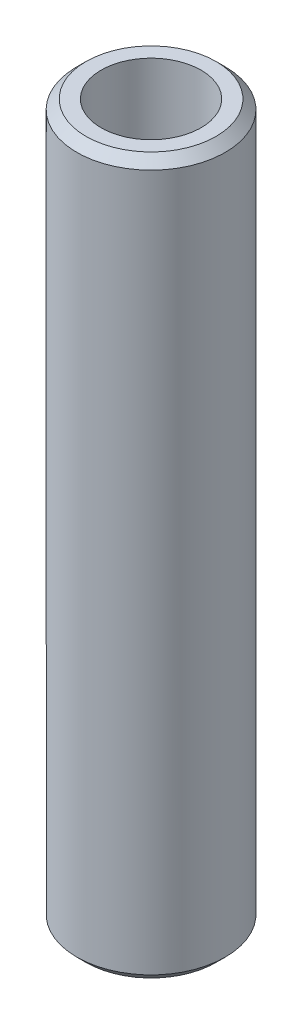
ISO-10303-21;
HEADER;
FILE_DESCRIPTION(('STEP AP214'),'2;1');
FILE_NAME('part.step','',(''),(''),'','','');
FILE_SCHEMA(('AUTOMOTIVE_DESIGN { 1 0 10303 214 1 1 1 1 }'));
ENDSEC;
DATA;
#1=APPLICATION_CONTEXT('core data for automotive mechanical design processes');
#2=APPLICATION_PROTOCOL_DEFINITION('international standard','automotive_design',2000,#1);
#3=PRODUCT_CONTEXT('',#1,'mechanical');
#4=PRODUCT('Part','Part','',(#3));
#5=PRODUCT_RELATED_PRODUCT_CATEGORY('part','',(#4));
#6=PRODUCT_DEFINITION_FORMATION('','',#4);
#7=PRODUCT_DEFINITION_CONTEXT('part definition',#1,'design');
#8=PRODUCT_DEFINITION('design','',#6,#7);
#9=PRODUCT_DEFINITION_SHAPE('','',#8);
#10=(LENGTH_UNIT() NAMED_UNIT(*) SI_UNIT(.MILLI.,.METRE.));
#11=(NAMED_UNIT(*) PLANE_ANGLE_UNIT() SI_UNIT($,.RADIAN.));
#12=(NAMED_UNIT(*) SI_UNIT($,.STERADIAN.) SOLID_ANGLE_UNIT());
#13=UNCERTAINTY_MEASURE_WITH_UNIT(LENGTH_MEASURE(1.E-05),#10,'distance_accuracy_value','');
#14=(GEOMETRIC_REPRESENTATION_CONTEXT(3) GLOBAL_UNCERTAINTY_ASSIGNED_CONTEXT((#13)) GLOBAL_UNIT_ASSIGNED_CONTEXT((#10,
#11,#12)) REPRESENTATION_CONTEXT('',''));
#15=CARTESIAN_POINT('',(0.,0.,0.));
#16=DIRECTION('',(0.,0.,1.));
#17=DIRECTION('',(1.,0.,0.));
#18=AXIS2_PLACEMENT_3D('',#15,#16,#17);
#19=CARTESIAN_POINT('',(0.,168.730452130798,0.));
#20=DIRECTION('',(0.,-1.,0.));
#21=DIRECTION('',(0.,0.,-1.));
#22=AXIS2_PLACEMENT_3D('',#19,#20,#21);
#23=CYLINDRICAL_SURFACE('',#22,17.5);
#24=CARTESIAN_POINT('',(0.,166.553626225241,0.));
#25=DIRECTION('',(0.,1.,0.));
#26=DIRECTION('',(0.,0.,1.));
#27=AXIS2_PLACEMENT_3D('',#24,#25,#26);
#28=CIRCLE('',#27,17.5);
#29=CARTESIAN_POINT('',(0.,166.553626225241,-17.5));
#30=VERTEX_POINT('',#29);
#31=EDGE_CURVE('E50',#30,#30,#28,.F.);
#32=CARTESIAN_POINT('',(0.,2.17682590555662,0.));
#33=DIRECTION('',(0.,1.,0.));
#34=DIRECTION('',(0.,0.,1.));
#35=AXIS2_PLACEMENT_3D('',#32,#33,#34);
#36=CIRCLE('',#35,17.5);
#37=CARTESIAN_POINT('',(0.,2.1768259055566,-17.5));
#38=VERTEX_POINT('',#37);
#39=EDGE_CURVE('E51',#38,#38,#36,.T.);
#40=CARTESIAN_POINT('',(0.,166.553626225241,-17.5));
#41=CARTESIAN_POINT('',(0.,164.841367888578,-17.5));
#42=CARTESIAN_POINT('',(0.,163.129109551914,-17.5));
#43=CARTESIAN_POINT('',(0.,159.704592878588,-17.5));
#44=CARTESIAN_POINT('',(0.,157.992334541924,-17.5));
#45=CARTESIAN_POINT('',(0.,154.567817868598,-17.5));
#46=CARTESIAN_POINT('',(0.,152.855559531934,-17.5));
#47=CARTESIAN_POINT('',(0.,149.431042858607,-17.5));
#48=CARTESIAN_POINT('',(0.,147.718784521944,-17.5));
#49=CARTESIAN_POINT('',(0.,144.294267848617,-17.5));
#50=CARTESIAN_POINT('',(0.,142.582009511954,-17.5));
#51=CARTESIAN_POINT('',(0.,139.157492838627,-17.5));
#52=CARTESIAN_POINT('',(0.,137.445234501964,-17.5));
#53=CARTESIAN_POINT('',(0.,134.020717828637,-17.5));
#54=CARTESIAN_POINT('',(0.,132.308459491974,-17.5));
#55=CARTESIAN_POINT('',(0.,128.883942818647,-17.5));
#56=CARTESIAN_POINT('',(0.,127.171684481983,-17.5));
#57=CARTESIAN_POINT('',(0.,123.747167808657,-17.5));
#58=CARTESIAN_POINT('',(0.,122.034909471993,-17.5));
#59=CARTESIAN_POINT('',(0.,118.610392798667,-17.5));
#60=CARTESIAN_POINT('',(0.,116.898134462003,-17.5));
#61=CARTESIAN_POINT('',(0.,113.473617788676,-17.5));
#62=CARTESIAN_POINT('',(0.,111.761359452013,-17.5));
#63=CARTESIAN_POINT('',(0.,108.336842778686,-17.5));
#64=CARTESIAN_POINT('',(0.,106.624584442023,-17.5));
#65=CARTESIAN_POINT('',(0.,103.200067768696,-17.5));
#66=CARTESIAN_POINT('',(0.,101.487809432033,-17.5));
#67=CARTESIAN_POINT('',(0.,98.063292758706,-17.5));
#68=CARTESIAN_POINT('',(0.,96.3510344220426,-17.5));
#69=CARTESIAN_POINT('',(0.,92.9265177487158,-17.5));
#70=CARTESIAN_POINT('',(0.,91.2142594120525,-17.5));
#71=CARTESIAN_POINT('',(0.,87.7897427387257,-17.5));
#72=CARTESIAN_POINT('',(0.,86.0774844020623,-17.5));
#73=CARTESIAN_POINT('',(0.,82.6529677287355,-17.5));
#74=CARTESIAN_POINT('',(0.,80.9407093920722,-17.5));
#75=CARTESIAN_POINT('',(0.,77.5161927187454,-17.5));
#76=CARTESIAN_POINT('',(0.,75.803934382082,-17.5));
#77=CARTESIAN_POINT('',(0.,72.3794177087553,-17.5));
#78=CARTESIAN_POINT('',(0.,70.6671593720919,-17.5));
#79=CARTESIAN_POINT('',(0.,67.2426426987651,-17.5));
#80=CARTESIAN_POINT('',(0.,65.5303843621017,-17.5));
#81=CARTESIAN_POINT('',(0.,62.105867688775,-17.5));
#82=CARTESIAN_POINT('',(0.,60.3936093521116,-17.5));
#83=CARTESIAN_POINT('',(0.,56.9690926787848,-17.5));
#84=CARTESIAN_POINT('',(0.,55.2568343421214,-17.5));
#85=CARTESIAN_POINT('',(0.,51.8323176687947,-17.5));
#86=CARTESIAN_POINT('',(0.,50.1200593321313,-17.5));
#87=CARTESIAN_POINT('',(0.,46.6955426588045,-17.5));
#88=CARTESIAN_POINT('',(0.,44.9832843221412,-17.5));
#89=CARTESIAN_POINT('',(0.,41.5587676488144,-17.5));
#90=CARTESIAN_POINT('',(0.,39.846509312151,-17.5));
#91=CARTESIAN_POINT('',(0.,36.4219926388242,-17.5));
#92=CARTESIAN_POINT('',(0.,34.7097343021609,-17.5));
#93=CARTESIAN_POINT('',(0.,31.2852176288341,-17.5));
#94=CARTESIAN_POINT('',(0.,29.5729592921707,-17.5));
#95=CARTESIAN_POINT('',(0.,26.1484426188439,-17.5));
#96=CARTESIAN_POINT('',(0.,24.4361842821806,-17.5));
#97=CARTESIAN_POINT('',(0.,21.0116676088538,-17.5));
#98=CARTESIAN_POINT('',(0.,19.2994092721904,-17.5));
#99=CARTESIAN_POINT('',(0.,15.8748925988637,-17.5));
#100=CARTESIAN_POINT('',(0.,14.1626342622003,-17.5));
#101=CARTESIAN_POINT('',(0.,10.7381175888735,-17.5));
#102=CARTESIAN_POINT('',(0.,9.02585925221013,-17.5));
#103=CARTESIAN_POINT('',(0.,5.60134257888337,-17.5));
#104=CARTESIAN_POINT('',(0.,3.88908424221998,-17.5));
#105=CARTESIAN_POINT('',(0.,2.1768259055566,-17.5));
#106=B_SPLINE_CURVE_WITH_KNOTS('',3,(#40,#41,#42,#43,#44,#45,#46,#47,#48,#49,#50,#51,#52,#53,
#54,#55,#56,#57,#58,#59,#60,#61,#62,#63,#64,#65,#66,#67,#68,#69,#70,#71,#72,#73,#74,#75,#76,#77,
#78,#79,#80,#81,#82,#83,#84,#85,#86,#87,#88,#89,#90,#91,#92,#93,#94,#95,#96,#97,#98,#99,#100,
#101,#102,#103,#104,#105),.UNSPECIFIED.,.F.,.F.,(4,2,2,2,2,2,2,2,2,2,2,2,2,2,2,2,2,2,2,2,2,2,2,
2,2,2,2,2,2,2,2,2,4),(0.,5.13677500999013,10.2735500199803,15.4103250299704,20.5471000399606,
25.6838750499507,30.8206500599409,35.957425069931,41.0942000799212,46.2309750899113,
51.3677500999014,56.5045251098916,61.6413001198817,66.7780751298719,71.914850139862,
77.0516251498522,82.1884001598423,87.3251751698325,92.4619501798226,97.5987251898128,
102.735500199803,107.872275209793,113.009050219783,118.145825229773,123.282600239763,
128.419375249754,133.556150259744,138.692925269734,143.829700279724,148.966475289714,
154.103250299704,159.240025309694,164.376800319685),.UNSPECIFIED.);
#107=EDGE_CURVE('BSEAM39',#30,#38,#106,.T.);
#108=ORIENTED_EDGE('',*,*,#31,.T.);
#109=ORIENTED_EDGE('',*,*,#39,.T.);
#110=ORIENTED_EDGE('',*,*,#107,.T.);
#111=ORIENTED_EDGE('',*,*,#107,.F.);
#112=EDGE_LOOP('',(#108,#110,#109,#111));
#113=FACE_BOUND('',#112,.T.);
#114=ADVANCED_FACE('F39',(#113),#23,.T.);
#115=CARTESIAN_POINT('',(0.,168.730452130798,0.));
#116=DIRECTION('',(0.,1.,0.));
#117=DIRECTION('',(0.,0.,1.));
#118=AXIS2_PLACEMENT_3D('',#115,#116,#117);
#119=PLANE('',#118);
#120=CARTESIAN_POINT('',(0.,168.730452130798,0.));
#121=DIRECTION('',(0.,1.,0.));
#122=DIRECTION('',(0.,0.,1.));
#123=AXIS2_PLACEMENT_3D('',#120,#121,#122);
#124=CIRCLE('',#123,15.3231740944437);
#125=CARTESIAN_POINT('',(0.,168.730452130798,15.3231740944437));
#126=VERTEX_POINT('',#125);
#127=EDGE_CURVE('E54',#126,#126,#124,.T.);
#128=ORIENTED_EDGE('',*,*,#127,.T.);
#129=EDGE_LOOP('',(#128));
#130=FACE_BOUND('',#129,.T.);
#131=CARTESIAN_POINT('',(0.,168.730452130798,0.));
#132=DIRECTION('',(0.,1.,0.));
#133=DIRECTION('',(0.,0.,1.));
#134=AXIS2_PLACEMENT_3D('',#131,#132,#133);
#135=CIRCLE('',#134,11.7880793473174);
#136=CARTESIAN_POINT('',(0.,168.730452130798,-11.7880793473174));
#137=VERTEX_POINT('',#136);
#138=EDGE_CURVE('E58',#137,#137,#135,.T.);
#139=ORIENTED_EDGE('',*,*,#138,.F.);
#140=EDGE_LOOP('',(#139));
#141=FACE_BOUND('',#140,.T.);
#142=ADVANCED_FACE('F69',(#130,#141),#119,.T.);
#143=CARTESIAN_POINT('',(0.,0.,0.));
#144=DIRECTION('',(0.,1.,0.));
#145=DIRECTION('',(0.,0.,1.));
#146=AXIS2_PLACEMENT_3D('',#143,#144,#145);
#147=PLANE('',#146);
#148=CARTESIAN_POINT('',(0.,0.,0.));
#149=DIRECTION('',(0.,1.,0.));
#150=DIRECTION('',(0.,0.,1.));
#151=AXIS2_PLACEMENT_3D('',#148,#149,#150);
#152=CIRCLE('',#151,15.3231740944434);
#153=CARTESIAN_POINT('',(0.,0.,15.3231740944434));
#154=VERTEX_POINT('',#153);
#155=EDGE_CURVE('E10',#154,#154,#152,.F.);
#156=ORIENTED_EDGE('',*,*,#155,.T.);
#157=EDGE_LOOP('',(#156));
#158=FACE_BOUND('',#157,.T.);
#159=CARTESIAN_POINT('',(0.,0.,0.));
#160=DIRECTION('',(0.,1.,0.));
#161=DIRECTION('',(0.,0.,1.));
#162=AXIS2_PLACEMENT_3D('',#159,#160,#161);
#163=CIRCLE('',#162,11.7880793473174);
#164=CARTESIAN_POINT('',(0.,0.,-11.7880793473174));
#165=VERTEX_POINT('',#164);
#166=EDGE_CURVE('E63',#165,#165,#163,.T.);
#167=ORIENTED_EDGE('',*,*,#166,.T.);
#168=EDGE_LOOP('',(#167));
#169=FACE_BOUND('',#168,.T.);
#170=ADVANCED_FACE('F75',(#158,#169),#147,.F.);
#171=CARTESIAN_POINT('',(0.,168.730452130798,0.));
#172=DIRECTION('',(0.,-1.,0.));
#173=DIRECTION('',(0.,0.,-1.));
#174=AXIS2_PLACEMENT_3D('',#171,#172,#173);
#175=CYLINDRICAL_SURFACE('',#174,11.7880793473174);
#176=CARTESIAN_POINT('',(0.,168.730452130798,-11.7880793473174));
#177=CARTESIAN_POINT('',(0.,166.972843254435,-11.7880793473174));
#178=CARTESIAN_POINT('',(0.,165.215234378073,-11.7880793473174));
#179=CARTESIAN_POINT('',(0.,161.700016625348,-11.7880793473174));
#180=CARTESIAN_POINT('',(0.,159.942407748985,-11.7880793473174));
#181=CARTESIAN_POINT('',(0.,156.42718999626,-11.7880793473174));
#182=CARTESIAN_POINT('',(0.,154.669581119898,-11.7880793473174));
#183=CARTESIAN_POINT('',(0.,151.154363367173,-11.7880793473174));
#184=CARTESIAN_POINT('',(0.,149.39675449081,-11.7880793473174));
#185=CARTESIAN_POINT('',(0.,145.881536738085,-11.7880793473174));
#186=CARTESIAN_POINT('',(0.,144.123927861723,-11.7880793473174));
#187=CARTESIAN_POINT('',(0.,140.608710108998,-11.7880793473174));
#188=CARTESIAN_POINT('',(0.,138.851101232636,-11.7880793473174));
#189=CARTESIAN_POINT('',(0.,135.335883479911,-11.7880793473174));
#190=CARTESIAN_POINT('',(0.,133.578274603548,-11.7880793473174));
#191=CARTESIAN_POINT('',(0.,130.063056850823,-11.7880793473174));
#192=CARTESIAN_POINT('',(0.,128.305447974461,-11.7880793473174));
#193=CARTESIAN_POINT('',(0.,124.790230221736,-11.7880793473174));
#194=CARTESIAN_POINT('',(0.,123.032621345373,-11.7880793473174));
#195=CARTESIAN_POINT('',(0.,119.517403592648,-11.7880793473174));
#196=CARTESIAN_POINT('',(0.,117.759794716286,-11.7880793473174));
#197=CARTESIAN_POINT('',(0.,114.244576963561,-11.7880793473174));
#198=CARTESIAN_POINT('',(0.,112.486968087198,-11.7880793473174));
#199=CARTESIAN_POINT('',(0.,108.971750334473,-11.7880793473174));
#200=CARTESIAN_POINT('',(0.,107.214141458111,-11.7880793473174));
#201=CARTESIAN_POINT('',(0.,103.698923705386,-11.7880793473174));
#202=CARTESIAN_POINT('',(0.,101.941314829024,-11.7880793473174));
#203=CARTESIAN_POINT('',(0.,98.4260970762986,-11.7880793473174));
#204=CARTESIAN_POINT('',(0.,96.6684881999361,-11.7880793473174));
#205=CARTESIAN_POINT('',(0.,93.1532704472112,-11.7880793473174));
#206=CARTESIAN_POINT('',(0.,91.3956615708487,-11.7880793473174));
#207=CARTESIAN_POINT('',(0.,87.8804438181237,-11.7880793473174));
#208=CARTESIAN_POINT('',(0.,86.1228349417613,-11.7880793473174));
#209=CARTESIAN_POINT('',(0.,82.6076171890363,-11.7880793473174));
#210=CARTESIAN_POINT('',(0.,80.8500083126738,-11.7880793473174));
#211=CARTESIAN_POINT('',(0.,77.3347905599489,-11.7880793473174));
#212=CARTESIAN_POINT('',(0.,75.5771816835864,-11.7880793473174));
#213=CARTESIAN_POINT('',(0.,72.0619639308615,-11.7880793473174));
#214=CARTESIAN_POINT('',(0.,70.304355054499,-11.7880793473174));
#215=CARTESIAN_POINT('',(0.,66.789137301774,-11.7880793473174));
#216=CARTESIAN_POINT('',(0.,65.0315284254116,-11.7880793473174));
#217=CARTESIAN_POINT('',(0.,61.5163106726866,-11.7880793473174));
#218=CARTESIAN_POINT('',(0.,59.7587017963241,-11.7880793473174));
#219=CARTESIAN_POINT('',(0.,56.2434840435992,-11.7880793473174));
#220=CARTESIAN_POINT('',(0.,54.4858751672367,-11.7880793473174));
#221=CARTESIAN_POINT('',(0.,50.9706574145117,-11.7880793473174));
#222=CARTESIAN_POINT('',(0.,49.2130485381493,-11.7880793473174));
#223=CARTESIAN_POINT('',(0.,45.6978307854243,-11.7880793473174));
#224=CARTESIAN_POINT('',(0.,43.9402219090619,-11.7880793473174));
#225=CARTESIAN_POINT('',(0.,40.4250041563369,-11.7880793473174));
#226=CARTESIAN_POINT('',(0.,38.6673952799745,-11.7880793473174));
#227=CARTESIAN_POINT('',(0.,35.1521775272495,-11.7880793473174));
#228=CARTESIAN_POINT('',(0.,33.394568650887,-11.7880793473174));
#229=CARTESIAN_POINT('',(0.,29.8793508981621,-11.7880793473174));
#230=CARTESIAN_POINT('',(0.,28.1217420217996,-11.7880793473174));
#231=CARTESIAN_POINT('',(0.,24.6065242690746,-11.7880793473174));
#232=CARTESIAN_POINT('',(0.,22.8489153927122,-11.7880793473174));
#233=CARTESIAN_POINT('',(0.,19.3336976399872,-11.7880793473174));
#234=CARTESIAN_POINT('',(0.,17.5760887636247,-11.7880793473174));
#235=CARTESIAN_POINT('',(0.,14.0608710108998,-11.7880793473174));
#236=CARTESIAN_POINT('',(0.,12.3032621345373,-11.7880793473174));
#237=CARTESIAN_POINT('',(0.,8.78804438181236,-11.7880793473174));
#238=CARTESIAN_POINT('',(0.,7.03043550544988,-11.7880793473174));
#239=CARTESIAN_POINT('',(0.,3.51521775272493,-11.7880793473174));
#240=CARTESIAN_POINT('',(0.,1.75760887636245,-11.7880793473174));
#241=CARTESIAN_POINT('',(0.,0.,-11.7880793473174));
#242=B_SPLINE_CURVE_WITH_KNOTS('',3,(#176,#177,#178,#179,#180,#181,#182,#183,#184,#185,#186,
#187,#188,#189,#190,#191,#192,#193,#194,#195,#196,#197,#198,#199,#200,#201,#202,#203,#204,#205,
#206,#207,#208,#209,#210,#211,#212,#213,#214,#215,#216,#217,#218,#219,#220,#221,#222,#223,#224,
#225,#226,#227,#228,#229,#230,#231,#232,#233,#234,#235,#236,#237,#238,#239,#240,#241),
.UNSPECIFIED.,.F.,.F.,(4,2,2,2,2,2,2,2,2,2,2,2,2,2,2,2,2,2,2,2,2,2,2,2,2,2,2,2,2,2,2,2,4),(0.,
5.27282662908743,10.5456532581749,15.8184798872623,21.0913065163497,26.3641331454371,
31.6369597745246,36.909786403612,42.1826130326994,47.4554396617869,52.7282662908743,
58.0010929199617,63.2739195490491,68.5467461781366,73.819572807224,79.0923994363114,
84.3652260653988,89.6380526944863,94.9108793235737,100.183705952661,105.456532581749,
110.729359210836,116.002185839923,121.275012469011,126.547839098098,131.820665727186,
137.093492356273,142.36631898536,147.639145614448,152.911972243535,158.184798872623,
163.45762550171,168.730452130798),.UNSPECIFIED.);
#243=EDGE_CURVE('BSEAM70',#137,#165,#242,.T.);
#244=ORIENTED_EDGE('',*,*,#138,.T.);
#245=ORIENTED_EDGE('',*,*,#166,.F.);
#246=ORIENTED_EDGE('',*,*,#243,.T.);
#247=ORIENTED_EDGE('',*,*,#243,.F.);
#248=EDGE_LOOP('',(#244,#246,#245,#247));
#249=FACE_BOUND('',#248,.T.);
#250=ADVANCED_FACE('F70',(#249),#175,.F.);
#251=CARTESIAN_POINT('',(0.,168.730452130798,0.));
#252=DIRECTION('',(0.,-1.,0.));
#253=DIRECTION('',(0.,0.,-1.));
#254=AXIS2_PLACEMENT_3D('',#251,#252,#253);
#255=CONICAL_SURFACE('',#254,15.3231740944437,0.785398163397447);
#256=ORIENTED_EDGE('',*,*,#31,.F.);
#257=EDGE_LOOP('',(#256));
#258=FACE_BOUND('',#257,.T.);
#259=ORIENTED_EDGE('',*,*,#127,.F.);
#260=EDGE_LOOP('',(#259));
#261=FACE_BOUND('',#260,.T.);
#262=ADVANCED_FACE('F81',(#258,#261),#255,.T.);
#263=CARTESIAN_POINT('',(0.,2.17682590555662,0.));
#264=DIRECTION('',(0.,1.,0.));
#265=DIRECTION('',(0.,0.,1.));
#266=AXIS2_PLACEMENT_3D('',#263,#264,#265);
#267=CONICAL_SURFACE('',#266,17.5,0.78539816339745);
#268=ORIENTED_EDGE('',*,*,#155,.F.);
#269=EDGE_LOOP('',(#268));
#270=FACE_BOUND('',#269,.T.);
#271=ORIENTED_EDGE('',*,*,#39,.F.);
#272=EDGE_LOOP('',(#271));
#273=FACE_BOUND('',#272,.T.);
#274=ADVANCED_FACE('F45',(#270,#273),#267,.T.);
#275=CLOSED_SHELL('',(#114,#142,#170,#250,#262,#274));
#276=MANIFOLD_SOLID_BREP('B2',#275);
#277=ADVANCED_BREP_SHAPE_REPRESENTATION('',(#18,#276),#14);
#278=SHAPE_DEFINITION_REPRESENTATION(#9,#277);
ENDSEC;
END-ISO-10303-21;
